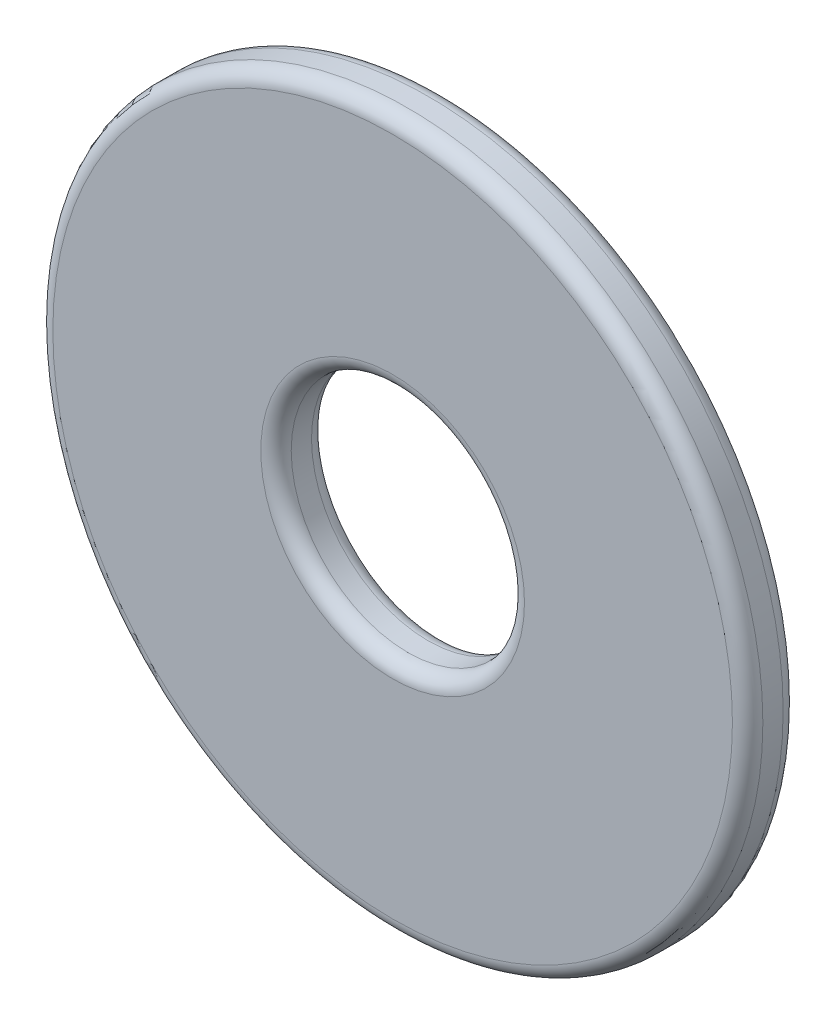
ISO-10303-21;
HEADER;
FILE_DESCRIPTION(('STEP AP214'),'2;1');
FILE_NAME('part.step','',(''),(''),'','','');
FILE_SCHEMA(('AUTOMOTIVE_DESIGN { 1 0 10303 214 1 1 1 1 }'));
ENDSEC;
DATA;
#1=APPLICATION_CONTEXT('core data for automotive mechanical design processes');
#2=APPLICATION_PROTOCOL_DEFINITION('international standard','automotive_design',2000,#1);
#3=PRODUCT_CONTEXT('',#1,'mechanical');
#4=PRODUCT('Part','Part','',(#3));
#5=PRODUCT_RELATED_PRODUCT_CATEGORY('part','',(#4));
#6=PRODUCT_DEFINITION_FORMATION('','',#4);
#7=PRODUCT_DEFINITION_CONTEXT('part definition',#1,'design');
#8=PRODUCT_DEFINITION('design','',#6,#7);
#9=PRODUCT_DEFINITION_SHAPE('','',#8);
#10=(LENGTH_UNIT() NAMED_UNIT(*) SI_UNIT(.MILLI.,.METRE.));
#11=(NAMED_UNIT(*) PLANE_ANGLE_UNIT() SI_UNIT($,.RADIAN.));
#12=(NAMED_UNIT(*) SI_UNIT($,.STERADIAN.) SOLID_ANGLE_UNIT());
#13=UNCERTAINTY_MEASURE_WITH_UNIT(LENGTH_MEASURE(1.E-05),#10,'distance_accuracy_value','');
#14=(GEOMETRIC_REPRESENTATION_CONTEXT(3) GLOBAL_UNCERTAINTY_ASSIGNED_CONTEXT((#13)) GLOBAL_UNIT_ASSIGNED_CONTEXT((#10,
#11,#12)) REPRESENTATION_CONTEXT('',''));
#15=CARTESIAN_POINT('',(0.,0.,0.));
#16=DIRECTION('',(0.,0.,1.));
#17=DIRECTION('',(1.,0.,0.));
#18=AXIS2_PLACEMENT_3D('',#15,#16,#17);
#19=CARTESIAN_POINT('',(0.,0.,0.25));
#20=DIRECTION('',(0.,0.,1.));
#21=DIRECTION('',(1.,0.,0.));
#22=AXIS2_PLACEMENT_3D('',#19,#20,#21);
#23=PLANE('',#22);
#24=CARTESIAN_POINT('',(0.,0.,0.25));
#25=DIRECTION('',(0.,0.,1.));
#26=DIRECTION('',(1.,0.,0.));
#27=AXIS2_PLACEMENT_3D('',#24,#25,#26);
#28=CIRCLE('',#27,1.3);
#29=CARTESIAN_POINT('',(1.3,0.,0.25));
#30=VERTEX_POINT('',#29);
#31=EDGE_CURVE('E60',#30,#30,#28,.F.);
#32=ORIENTED_EDGE('',*,*,#31,.T.);
#33=EDGE_LOOP('',(#32));
#34=FACE_BOUND('',#33,.T.);
#35=CARTESIAN_POINT('',(0.,0.,0.25));
#36=DIRECTION('',(0.,0.,1.));
#37=DIRECTION('',(1.,0.,0.));
#38=AXIS2_PLACEMENT_3D('',#35,#36,#37);
#39=CIRCLE('',#38,3.35);
#40=CARTESIAN_POINT('',(3.35,0.,0.25));
#41=VERTEX_POINT('',#40);
#42=EDGE_CURVE('E64',#41,#41,#39,.T.);
#43=ORIENTED_EDGE('',*,*,#42,.T.);
#44=EDGE_LOOP('',(#43));
#45=FACE_BOUND('',#44,.T.);
#46=ADVANCED_FACE('F49',(#34,#45),#23,.T.);
#47=CARTESIAN_POINT('',(0.,0.,-0.25));
#48=DIRECTION('',(0.,0.,1.));
#49=DIRECTION('',(1.,0.,0.));
#50=AXIS2_PLACEMENT_3D('',#47,#48,#49);
#51=PLANE('',#50);
#52=CARTESIAN_POINT('',(0.,0.,-0.25));
#53=DIRECTION('',(0.,0.,1.));
#54=DIRECTION('',(1.,0.,0.));
#55=AXIS2_PLACEMENT_3D('',#52,#53,#54);
#56=CIRCLE('',#55,1.3);
#57=CARTESIAN_POINT('',(1.3,0.,-0.25));
#58=VERTEX_POINT('',#57);
#59=EDGE_CURVE('E75',#58,#58,#56,.T.);
#60=ORIENTED_EDGE('',*,*,#59,.T.);
#61=EDGE_LOOP('',(#60));
#62=FACE_BOUND('',#61,.T.);
#63=CARTESIAN_POINT('',(0.,0.,-0.25));
#64=DIRECTION('',(0.,0.,1.));
#65=DIRECTION('',(1.,0.,0.));
#66=AXIS2_PLACEMENT_3D('',#63,#64,#65);
#67=CIRCLE('',#66,3.35);
#68=CARTESIAN_POINT('',(3.35,0.,-0.25));
#69=VERTEX_POINT('',#68);
#70=EDGE_CURVE('E78',#69,#69,#67,.F.);
#71=ORIENTED_EDGE('',*,*,#70,.T.);
#72=EDGE_LOOP('',(#71));
#73=FACE_BOUND('',#72,.T.);
#74=ADVANCED_FACE('F82',(#62,#73),#51,.F.);
#75=CARTESIAN_POINT('',(0.,0.,0.25));
#76=DIRECTION('',(0.,0.,-1.));
#77=DIRECTION('',(-1.,0.,0.));
#78=AXIS2_PLACEMENT_3D('',#75,#76,#77);
#79=CYLINDRICAL_SURFACE('',#78,3.5);
#80=CARTESIAN_POINT('',(0.,0.,-0.100000000000003));
#81=DIRECTION('',(0.,0.,1.));
#82=DIRECTION('',(1.,0.,0.));
#83=AXIS2_PLACEMENT_3D('',#80,#81,#82);
#84=CIRCLE('',#83,3.5);
#85=CARTESIAN_POINT('',(3.5,0.,-0.100000000000003));
#86=VERTEX_POINT('',#85);
#87=EDGE_CURVE('E12',#86,#86,#84,.T.);
#88=ORIENTED_EDGE('',*,*,#87,.T.);
#89=EDGE_LOOP('',(#88));
#90=FACE_BOUND('',#89,.T.);
#91=CARTESIAN_POINT('',(0.,0.,0.100000000000003));
#92=DIRECTION('',(0.,0.,1.));
#93=DIRECTION('',(1.,0.,0.));
#94=AXIS2_PLACEMENT_3D('',#91,#92,#93);
#95=CIRCLE('',#94,3.5);
#96=CARTESIAN_POINT('',(3.5,0.,0.100000000000003));
#97=VERTEX_POINT('',#96);
#98=EDGE_CURVE('E56',#97,#97,#95,.F.);
#99=ORIENTED_EDGE('',*,*,#98,.T.);
#100=EDGE_LOOP('',(#99));
#101=FACE_BOUND('',#100,.T.);
#102=ADVANCED_FACE('F102',(#90,#101),#79,.T.);
#103=CARTESIAN_POINT('',(0.,0.,0.25));
#104=DIRECTION('',(0.,0.,-1.));
#105=DIRECTION('',(-1.,0.,0.));
#106=AXIS2_PLACEMENT_3D('',#103,#104,#105);
#107=CYLINDRICAL_SURFACE('',#106,1.15);
#108=CARTESIAN_POINT('',(0.,0.,-0.100000000000003));
#109=DIRECTION('',(0.,0.,1.));
#110=DIRECTION('',(1.,0.,0.));
#111=AXIS2_PLACEMENT_3D('',#108,#109,#110);
#112=CIRCLE('',#111,1.15);
#113=CARTESIAN_POINT('',(1.15,0.,-0.100000000000003));
#114=VERTEX_POINT('',#113);
#115=EDGE_CURVE('E69',#114,#114,#112,.F.);
#116=ORIENTED_EDGE('',*,*,#115,.T.);
#117=EDGE_LOOP('',(#116));
#118=FACE_BOUND('',#117,.T.);
#119=CARTESIAN_POINT('',(0.,0.,0.100000000000003));
#120=DIRECTION('',(0.,0.,1.));
#121=DIRECTION('',(1.,0.,0.));
#122=AXIS2_PLACEMENT_3D('',#119,#120,#121);
#123=CIRCLE('',#122,1.15);
#124=CARTESIAN_POINT('',(1.15,0.,0.100000000000003));
#125=VERTEX_POINT('',#124);
#126=EDGE_CURVE('E72',#125,#125,#123,.T.);
#127=ORIENTED_EDGE('',*,*,#126,.T.);
#128=EDGE_LOOP('',(#127));
#129=FACE_BOUND('',#128,.T.);
#130=ADVANCED_FACE('F107',(#118,#129),#107,.F.);
#131=CARTESIAN_POINT('',(0.,0.,-0.100000000000003));
#132=DIRECTION('',(0.,0.,1.));
#133=DIRECTION('',(1.,0.,0.));
#134=AXIS2_PLACEMENT_3D('',#131,#132,#133);
#135=TOROIDAL_SURFACE('',#134,1.3,0.15);
#136=ORIENTED_EDGE('',*,*,#115,.F.);
#137=EDGE_LOOP('',(#136));
#138=FACE_BOUND('',#137,.T.);
#139=ORIENTED_EDGE('',*,*,#59,.F.);
#140=EDGE_LOOP('',(#139));
#141=FACE_BOUND('',#140,.T.);
#142=ADVANCED_FACE('F93',(#138,#141),#135,.T.);
#143=CARTESIAN_POINT('',(0.,0.,0.100000000000003));
#144=DIRECTION('',(0.,0.,1.));
#145=DIRECTION('',(1.,0.,0.));
#146=AXIS2_PLACEMENT_3D('',#143,#144,#145);
#147=TOROIDAL_SURFACE('',#146,1.3,0.15);
#148=ORIENTED_EDGE('',*,*,#31,.F.);
#149=EDGE_LOOP('',(#148));
#150=FACE_BOUND('',#149,.T.);
#151=ORIENTED_EDGE('',*,*,#126,.F.);
#152=EDGE_LOOP('',(#151));
#153=FACE_BOUND('',#152,.T.);
#154=ADVANCED_FACE('F87',(#150,#153),#147,.T.);
#155=CARTESIAN_POINT('',(0.,0.,-0.100000000000003));
#156=DIRECTION('',(0.,0.,1.));
#157=DIRECTION('',(1.,0.,0.));
#158=AXIS2_PLACEMENT_3D('',#155,#156,#157);
#159=TOROIDAL_SURFACE('',#158,3.35,0.15);
#160=ORIENTED_EDGE('',*,*,#70,.F.);
#161=EDGE_LOOP('',(#160));
#162=FACE_BOUND('',#161,.T.);
#163=ORIENTED_EDGE('',*,*,#87,.F.);
#164=EDGE_LOOP('',(#163));
#165=FACE_BOUND('',#164,.T.);
#166=ADVANCED_FACE('F84',(#162,#165),#159,.T.);
#167=CARTESIAN_POINT('',(0.,0.,0.100000000000003));
#168=DIRECTION('',(0.,0.,1.));
#169=DIRECTION('',(1.,0.,0.));
#170=AXIS2_PLACEMENT_3D('',#167,#168,#169);
#171=TOROIDAL_SURFACE('',#170,3.35,0.15);
#172=ORIENTED_EDGE('',*,*,#98,.F.);
#173=EDGE_LOOP('',(#172));
#174=FACE_BOUND('',#173,.T.);
#175=ORIENTED_EDGE('',*,*,#42,.F.);
#176=EDGE_LOOP('',(#175));
#177=FACE_BOUND('',#176,.T.);
#178=ADVANCED_FACE('F51',(#174,#177),#171,.T.);
#179=CLOSED_SHELL('',(#46,#74,#102,#130,#142,#154,#166,#178));
#180=MANIFOLD_SOLID_BREP('B2',#179);
#181=ADVANCED_BREP_SHAPE_REPRESENTATION('',(#18,#180),#14);
#182=SHAPE_DEFINITION_REPRESENTATION(#9,#181);
ENDSEC;
END-ISO-10303-21;
